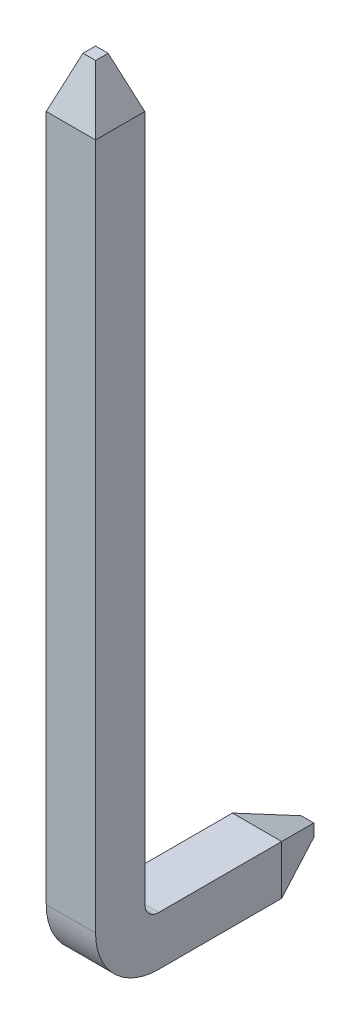
ISO-10303-21;
HEADER;
FILE_DESCRIPTION(('STEP AP214'),'2;1');
FILE_NAME('part.step','',(''),(''),'','','');
FILE_SCHEMA(('AUTOMOTIVE_DESIGN { 1 0 10303 214 1 1 1 1 }'));
ENDSEC;
DATA;
#1=APPLICATION_CONTEXT('core data for automotive mechanical design processes');
#2=APPLICATION_PROTOCOL_DEFINITION('international standard','automotive_design',2000,#1);
#3=PRODUCT_CONTEXT('',#1,'mechanical');
#4=PRODUCT('Part','Part','',(#3));
#5=PRODUCT_RELATED_PRODUCT_CATEGORY('part','',(#4));
#6=PRODUCT_DEFINITION_FORMATION('','',#4);
#7=PRODUCT_DEFINITION_CONTEXT('part definition',#1,'design');
#8=PRODUCT_DEFINITION('design','',#6,#7);
#9=PRODUCT_DEFINITION_SHAPE('','',#8);
#10=(LENGTH_UNIT() NAMED_UNIT(*) SI_UNIT(.MILLI.,.METRE.));
#11=(NAMED_UNIT(*) PLANE_ANGLE_UNIT() SI_UNIT($,.RADIAN.));
#12=(NAMED_UNIT(*) SI_UNIT($,.STERADIAN.) SOLID_ANGLE_UNIT());
#13=UNCERTAINTY_MEASURE_WITH_UNIT(LENGTH_MEASURE(1.E-05),#10,'distance_accuracy_value','');
#14=(GEOMETRIC_REPRESENTATION_CONTEXT(3) GLOBAL_UNCERTAINTY_ASSIGNED_CONTEXT((#13)) GLOBAL_UNIT_ASSIGNED_CONTEXT((#10,
#11,#12)) REPRESENTATION_CONTEXT('',''));
#15=CARTESIAN_POINT('',(0.,0.,0.));
#16=DIRECTION('',(0.,0.,1.));
#17=DIRECTION('',(1.,0.,0.));
#18=AXIS2_PLACEMENT_3D('',#15,#16,#17);
#19=CARTESIAN_POINT('',(0.,-9.5,-2.3987832623172));
#20=DIRECTION('',(0.939692620785909,0.,0.342020143325666));
#21=DIRECTION('',(0.342020143325666,0.,-0.939692620785909));
#22=AXIS2_PLACEMENT_3D('',#19,#20,#21);
#23=PLANE('',#22);
#24=DIRECTION('',(0.,1.,0.));
#25=VECTOR('',#24,1.);
#26=CARTESIAN_POINT('',(0.236580652273031,-10.3137832623172,-3.04878326231721));
#27=LINE('',#26,#25);
#28=CARTESIAN_POINT('',(0.236580652273031,-10.0772026100442,-3.04878326231721));
#29=VERTEX_POINT('',#28);
#30=CARTESIAN_POINT('',(0.236580652273031,-9.91536391459024,-3.04878326231721));
#31=VERTEX_POINT('',#30);
#32=EDGE_CURVE('E106',#29,#31,#27,.T.);
#33=ORIENTED_EDGE('',*,*,#32,.F.);
#34=DIRECTION('',(0.323615577118183,0.323615577118182,-0.88912649071599));
#35=VECTOR('',#34,1.);
#36=CARTESIAN_POINT('',(0.,-10.3137832623172,-2.3987832623172));
#37=LINE('',#36,#35);
#38=CARTESIAN_POINT('',(0.,-10.3137832623172,-2.3987832623172));
#39=VERTEX_POINT('',#38);
#40=EDGE_CURVE('E110',#39,#29,#37,.T.);
#41=ORIENTED_EDGE('',*,*,#40,.F.);
#42=DIRECTION('',(0.,1.,0.));
#43=VECTOR('',#42,1.);
#44=CARTESIAN_POINT('',(0.,-9.5,-2.3987832623172));
#45=LINE('',#44,#43);
#46=CARTESIAN_POINT('',(0.,-9.67878326231721,-2.3987832623172));
#47=VERTEX_POINT('',#46);
#48=EDGE_CURVE('E213',#47,#39,#45,.F.);
#49=ORIENTED_EDGE('',*,*,#48,.F.);
#50=DIRECTION('',(-0.323615577118183,0.323615577118182,0.88912649071599));
#51=VECTOR('',#50,1.);
#52=CARTESIAN_POINT('',(0.236580652273031,-9.91536391459024,-3.04878326231721));
#53=LINE('',#52,#51);
#54=EDGE_CURVE('E113',#31,#47,#53,.T.);
#55=ORIENTED_EDGE('',*,*,#54,.F.);
#56=EDGE_LOOP('',(#33,#41,#49,#55));
#57=FACE_BOUND('',#56,.T.);
#58=ADVANCED_FACE('F16',(#57),#23,.F.);
#59=CARTESIAN_POINT('',(0.236580652273031,0.,0.));
#60=DIRECTION('',(-0.939692620785909,0.342020143325666,0.));
#61=DIRECTION('',(-0.342020143325666,-0.939692620785909,0.));
#62=AXIS2_PLACEMENT_3D('',#59,#60,#61);
#63=PLANE('',#62);
#64=DIRECTION('',(0.323615577118183,0.88912649071599,0.323615577118183));
#65=VECTOR('',#64,1.);
#66=CARTESIAN_POINT('',(0.,-0.650000000000005,-0.635));
#67=LINE('',#66,#65);
#68=CARTESIAN_POINT('',(0.,-0.650000000000005,-0.635));
#69=VERTEX_POINT('',#68);
#70=CARTESIAN_POINT('',(0.236580652273031,0.,-0.398419347726969));
#71=VERTEX_POINT('',#70);
#72=EDGE_CURVE('E139',#69,#71,#67,.T.);
#73=ORIENTED_EDGE('',*,*,#72,.F.);
#74=DIRECTION('',(0.,0.,1.));
#75=VECTOR('',#74,1.);
#76=CARTESIAN_POINT('',(0.,-0.650000000000005,0.));
#77=LINE('',#76,#75);
#78=CARTESIAN_POINT('',(0.,-0.650000000000005,0.));
#79=VERTEX_POINT('',#78);
#80=EDGE_CURVE('E77',#79,#69,#77,.F.);
#81=ORIENTED_EDGE('',*,*,#80,.F.);
#82=DIRECTION('',(-0.323615577118183,-0.88912649071599,0.323615577118183));
#83=VECTOR('',#82,1.);
#84=CARTESIAN_POINT('',(0.236580652273031,0.,-0.236580652273031));
#85=LINE('',#84,#83);
#86=CARTESIAN_POINT('',(0.236580652273031,0.,-0.236580652273031));
#87=VERTEX_POINT('',#86);
#88=EDGE_CURVE('E197',#87,#79,#85,.T.);
#89=ORIENTED_EDGE('',*,*,#88,.F.);
#90=DIRECTION('',(0.,0.,-1.));
#91=VECTOR('',#90,1.);
#92=CARTESIAN_POINT('',(0.236580652273031,0.,0.));
#93=LINE('',#92,#91);
#94=EDGE_CURVE('E136',#87,#71,#93,.T.);
#95=ORIENTED_EDGE('',*,*,#94,.T.);
#96=EDGE_LOOP('',(#73,#81,#89,#95));
#97=FACE_BOUND('',#96,.T.);
#98=ADVANCED_FACE('F315',(#97),#63,.T.);
#99=CARTESIAN_POINT('',(0.,-10.3137832623172,-3.04878326231721));
#100=DIRECTION('',(0.,0.,-1.));
#101=DIRECTION('',(0.,1.,0.));
#102=AXIS2_PLACEMENT_3D('',#99,#100,#101);
#103=PLANE('',#102);
#104=ORIENTED_EDGE('',*,*,#32,.T.);
#105=DIRECTION('',(1.,0.,0.));
#106=VECTOR('',#105,1.);
#107=CARTESIAN_POINT('',(0.,-9.91536391459024,-3.04878326231721));
#108=LINE('',#107,#106);
#109=CARTESIAN_POINT('',(0.398419347726965,-9.91536391459024,-3.04878326231721));
#110=VERTEX_POINT('',#109);
#111=EDGE_CURVE('E124',#110,#31,#108,.F.);
#112=ORIENTED_EDGE('',*,*,#111,.F.);
#113=DIRECTION('',(0.,1.,0.));
#114=VECTOR('',#113,1.);
#115=CARTESIAN_POINT('',(0.398419347726966,-9.5,-3.04878326231721));
#116=LINE('',#115,#114);
#117=CARTESIAN_POINT('',(0.398419347726965,-10.0772026100442,-3.04878326231721));
#118=VERTEX_POINT('',#117);
#119=EDGE_CURVE('E120',#110,#118,#116,.F.);
#120=ORIENTED_EDGE('',*,*,#119,.T.);
#121=DIRECTION('',(1.,0.,0.));
#122=VECTOR('',#121,1.);
#123=CARTESIAN_POINT('',(0.,-10.0772026100442,-3.04878326231721));
#124=LINE('',#123,#122);
#125=EDGE_CURVE('E117',#29,#118,#124,.T.);
#126=ORIENTED_EDGE('',*,*,#125,.F.);
#127=EDGE_LOOP('',(#104,#112,#120,#126));
#128=FACE_BOUND('',#127,.T.);
#129=ADVANCED_FACE('F118',(#128),#103,.T.);
#130=CARTESIAN_POINT('',(0.,-10.3137832623172,-2.3987832623172));
#131=DIRECTION('',(0.,-0.93969262078591,-0.342020143325666));
#132=DIRECTION('',(0.,0.342020143325666,-0.93969262078591));
#133=AXIS2_PLACEMENT_3D('',#130,#131,#132);
#134=PLANE('',#133);
#135=DIRECTION('',(0.323615577118182,-0.323615577118184,0.889126490715989));
#136=VECTOR('',#135,1.);
#137=CARTESIAN_POINT('',(0.398419347726965,-10.0772026100442,-3.04878326231721));
#138=LINE('',#137,#136);
#139=CARTESIAN_POINT('',(0.634999999999997,-10.3137832623172,-2.3987832623172));
#140=VERTEX_POINT('',#139);
#141=EDGE_CURVE('E176',#118,#140,#138,.T.);
#142=ORIENTED_EDGE('',*,*,#141,.T.);
#143=DIRECTION('',(1.,0.,0.));
#144=VECTOR('',#143,1.);
#145=CARTESIAN_POINT('',(0.,-10.3137832623172,-2.3987832623172));
#146=LINE('',#145,#144);
#147=EDGE_CURVE('E128',#140,#39,#146,.F.);
#148=ORIENTED_EDGE('',*,*,#147,.T.);
#149=ORIENTED_EDGE('',*,*,#40,.T.);
#150=ORIENTED_EDGE('',*,*,#125,.T.);
#151=EDGE_LOOP('',(#142,#148,#149,#150));
#152=FACE_BOUND('',#151,.T.);
#153=ADVANCED_FACE('F126',(#152),#134,.T.);
#154=CARTESIAN_POINT('',(0.,-9.67878326231721,-2.3987832623172));
#155=DIRECTION('',(0.,0.93969262078591,-0.342020143325665));
#156=DIRECTION('',(0.,0.342020143325665,0.93969262078591));
#157=AXIS2_PLACEMENT_3D('',#154,#155,#156);
#158=PLANE('',#157);
#159=ORIENTED_EDGE('',*,*,#54,.T.);
#160=DIRECTION('',(1.,0.,0.));
#161=VECTOR('',#160,1.);
#162=CARTESIAN_POINT('',(0.,-9.67878326231721,-2.3987832623172));
#163=LINE('',#162,#161);
#164=CARTESIAN_POINT('',(0.634999999999997,-9.67878326231721,-2.3987832623172));
#165=VERTEX_POINT('',#164);
#166=EDGE_CURVE('E150',#47,#165,#163,.T.);
#167=ORIENTED_EDGE('',*,*,#166,.T.);
#168=DIRECTION('',(-0.323615577118183,-0.323615577118182,-0.88912649071599));
#169=VECTOR('',#168,1.);
#170=CARTESIAN_POINT('',(0.634999999999997,-9.67878326231721,-2.3987832623172));
#171=LINE('',#170,#169);
#172=EDGE_CURVE('E163',#165,#110,#171,.T.);
#173=ORIENTED_EDGE('',*,*,#172,.T.);
#174=ORIENTED_EDGE('',*,*,#111,.T.);
#175=EDGE_LOOP('',(#159,#167,#173,#174));
#176=FACE_BOUND('',#175,.T.);
#177=ADVANCED_FACE('F238',(#176),#158,.T.);
#178=CARTESIAN_POINT('',(0.,0.,-0.398419347726969));
#179=DIRECTION('',(0.,0.342020143325666,-0.939692620785909));
#180=DIRECTION('',(0.,0.939692620785909,0.342020143325666));
#181=AXIS2_PLACEMENT_3D('',#178,#179,#180);
#182=PLANE('',#181);
#183=ORIENTED_EDGE('',*,*,#72,.T.);
#184=DIRECTION('',(1.,0.,0.));
#185=VECTOR('',#184,1.);
#186=CARTESIAN_POINT('',(0.,0.,-0.398419347726969));
#187=LINE('',#186,#185);
#188=CARTESIAN_POINT('',(0.398419347726965,0.,-0.398419347726969));
#189=VERTEX_POINT('',#188);
#190=EDGE_CURVE('E138',#71,#189,#187,.T.);
#191=ORIENTED_EDGE('',*,*,#190,.T.);
#192=DIRECTION('',(-0.323615577118183,0.88912649071599,0.323615577118183));
#193=VECTOR('',#192,1.);
#194=CARTESIAN_POINT('',(0.634999999999997,-0.650000000000005,-0.635));
#195=LINE('',#194,#193);
#196=CARTESIAN_POINT('',(0.634999999999997,-0.650000000000005,-0.635000000000001));
#197=VERTEX_POINT('',#196);
#198=EDGE_CURVE('E205',#197,#189,#195,.T.);
#199=ORIENTED_EDGE('',*,*,#198,.F.);
#200=DIRECTION('',(1.,0.,0.));
#201=VECTOR('',#200,1.);
#202=CARTESIAN_POINT('',(0.,-0.650000000000005,-0.635));
#203=LINE('',#202,#201);
#204=EDGE_CURVE('E218',#69,#197,#203,.T.);
#205=ORIENTED_EDGE('',*,*,#204,.F.);
#206=EDGE_LOOP('',(#183,#191,#199,#205));
#207=FACE_BOUND('',#206,.T.);
#208=ADVANCED_FACE('F320',(#207),#182,.T.);
#209=CARTESIAN_POINT('',(0.,0.,0.));
#210=DIRECTION('',(0.,-1.,0.));
#211=DIRECTION('',(0.,0.,-1.));
#212=AXIS2_PLACEMENT_3D('',#209,#210,#211);
#213=PLANE('',#212);
#214=ORIENTED_EDGE('',*,*,#190,.F.);
#215=ORIENTED_EDGE('',*,*,#94,.F.);
#216=DIRECTION('',(1.,0.,0.));
#217=VECTOR('',#216,1.);
#218=CARTESIAN_POINT('',(0.,0.,-0.236580652273031));
#219=LINE('',#218,#217);
#220=CARTESIAN_POINT('',(0.398419347726965,0.,-0.236580652273031));
#221=VERTEX_POINT('',#220);
#222=EDGE_CURVE('E199',#221,#87,#219,.F.);
#223=ORIENTED_EDGE('',*,*,#222,.F.);
#224=DIRECTION('',(0.,0.,1.));
#225=VECTOR('',#224,1.);
#226=CARTESIAN_POINT('',(0.398419347726965,0.,0.));
#227=LINE('',#226,#225);
#228=EDGE_CURVE('E202',#189,#221,#227,.T.);
#229=ORIENTED_EDGE('',*,*,#228,.F.);
#230=EDGE_LOOP('',(#214,#215,#223,#229));
#231=FACE_BOUND('',#230,.T.);
#232=ADVANCED_FACE('F318',(#231),#213,.F.);
#233=CARTESIAN_POINT('',(0.,0.,-0.236580652273031));
#234=DIRECTION('',(0.,0.342020143325666,0.939692620785909));
#235=DIRECTION('',(0.,-0.939692620785909,0.342020143325666));
#236=AXIS2_PLACEMENT_3D('',#233,#234,#235);
#237=PLANE('',#236);
#238=DIRECTION('',(0.323615577118183,-0.88912649071599,0.323615577118183));
#239=VECTOR('',#238,1.);
#240=CARTESIAN_POINT('',(0.398419347726965,0.,-0.236580652273031));
#241=LINE('',#240,#239);
#242=CARTESIAN_POINT('',(0.634999999999997,-0.650000000000005,0.));
#243=VERTEX_POINT('',#242);
#244=EDGE_CURVE('E285',#221,#243,#241,.T.);
#245=ORIENTED_EDGE('',*,*,#244,.F.);
#246=ORIENTED_EDGE('',*,*,#222,.T.);
#247=ORIENTED_EDGE('',*,*,#88,.T.);
#248=DIRECTION('',(1.,0.,0.));
#249=VECTOR('',#248,1.);
#250=CARTESIAN_POINT('',(0.,-0.650000000000005,0.));
#251=LINE('',#250,#249);
#252=EDGE_CURVE('E191',#243,#79,#251,.F.);
#253=ORIENTED_EDGE('',*,*,#252,.F.);
#254=EDGE_LOOP('',(#245,#246,#247,#253));
#255=FACE_BOUND('',#254,.T.);
#256=ADVANCED_FACE('F312',(#255),#237,.T.);
#257=CARTESIAN_POINT('',(0.,-9.5,0.));
#258=DIRECTION('',(-1.,0.,0.));
#259=DIRECTION('',(0.,0.,1.));
#260=AXIS2_PLACEMENT_3D('',#257,#258,#259);
#261=PLANE('',#260);
#262=DIRECTION('',(0.,1.,0.));
#263=VECTOR('',#262,1.);
#264=CARTESIAN_POINT('',(0.,-9.5,-0.635000000000001));
#265=LINE('',#264,#263);
#266=CARTESIAN_POINT('',(0.,-9.5,-0.635000000000001));
#267=VERTEX_POINT('',#266);
#268=EDGE_CURVE('E154',#267,#69,#265,.T.);
#269=ORIENTED_EDGE('',*,*,#268,.F.);
#270=CARTESIAN_POINT('',(0.,-9.5,-0.813783262317208));
#271=DIRECTION('',(1.,0.,0.));
#272=DIRECTION('',(0.,0.,-1.));
#273=AXIS2_PLACEMENT_3D('',#270,#271,#272);
#274=CIRCLE('',#273,0.178783262317206);
#275=CARTESIAN_POINT('',(0.,-9.67878326231721,-0.813783262317208));
#276=VERTEX_POINT('',#275);
#277=EDGE_CURVE('E148',#267,#276,#274,.T.);
#278=ORIENTED_EDGE('',*,*,#277,.T.);
#279=DIRECTION('',(0.,0.,-1.));
#280=VECTOR('',#279,1.);
#281=CARTESIAN_POINT('',(0.,-9.67878326231721,-0.813783262317208));
#282=LINE('',#281,#280);
#283=EDGE_CURVE('E157',#276,#47,#282,.T.);
#284=ORIENTED_EDGE('',*,*,#283,.T.);
#285=ORIENTED_EDGE('',*,*,#48,.T.);
#286=DIRECTION('',(0.,0.,1.));
#287=VECTOR('',#286,1.);
#288=CARTESIAN_POINT('',(0.,-10.3137832623172,-0.813783262317208));
#289=LINE('',#288,#287);
#290=CARTESIAN_POINT('',(0.,-10.3137832623172,-0.813783262317208));
#291=VERTEX_POINT('',#290);
#292=EDGE_CURVE('E183',#39,#291,#289,.T.);
#293=ORIENTED_EDGE('',*,*,#292,.T.);
#294=CARTESIAN_POINT('',(0.,-9.5,-0.813783262317208));
#295=DIRECTION('',(1.,0.,0.));
#296=DIRECTION('',(0.,0.,-1.));
#297=AXIS2_PLACEMENT_3D('',#294,#295,#296);
#298=CIRCLE('',#297,0.813783262317207);
#299=CARTESIAN_POINT('',(0.,-9.5,0.));
#300=VERTEX_POINT('',#299);
#301=EDGE_CURVE('E19',#291,#300,#298,.F.);
#302=ORIENTED_EDGE('',*,*,#301,.T.);
#303=DIRECTION('',(0.,-1.,0.));
#304=VECTOR('',#303,1.);
#305=CARTESIAN_POINT('',(0.,-9.5,0.));
#306=LINE('',#305,#304);
#307=EDGE_CURVE('E189',#79,#300,#306,.T.);
#308=ORIENTED_EDGE('',*,*,#307,.F.);
#309=ORIENTED_EDGE('',*,*,#80,.T.);
#310=EDGE_LOOP('',(#269,#278,#284,#285,#293,#302,#308,#309));
#311=FACE_BOUND('',#310,.T.);
#312=ADVANCED_FACE('F249',(#311),#261,.T.);
#313=CARTESIAN_POINT('',(0.,-10.3137832623172,-0.813783262317208));
#314=DIRECTION('',(0.,1.,0.));
#315=DIRECTION('',(0.,0.,1.));
#316=AXIS2_PLACEMENT_3D('',#313,#314,#315);
#317=PLANE('',#316);
#318=ORIENTED_EDGE('',*,*,#147,.F.);
#319=DIRECTION('',(0.,0.,-1.));
#320=VECTOR('',#319,1.);
#321=CARTESIAN_POINT('',(0.634999999999997,-10.3137832623172,0.));
#322=LINE('',#321,#320);
#323=CARTESIAN_POINT('',(0.634999999999997,-10.3137832623172,-0.813783262317208));
#324=VERTEX_POINT('',#323);
#325=EDGE_CURVE('E172',#324,#140,#322,.T.);
#326=ORIENTED_EDGE('',*,*,#325,.F.);
#327=DIRECTION('',(1.,0.,0.));
#328=VECTOR('',#327,1.);
#329=CARTESIAN_POINT('',(0.,-10.3137832623172,-0.813783262317208));
#330=LINE('',#329,#328);
#331=EDGE_CURVE('E248',#291,#324,#330,.T.);
#332=ORIENTED_EDGE('',*,*,#331,.F.);
#333=ORIENTED_EDGE('',*,*,#292,.F.);
#334=EDGE_LOOP('',(#318,#326,#332,#333));
#335=FACE_BOUND('',#334,.T.);
#336=ADVANCED_FACE('F246',(#335),#317,.F.);
#337=CARTESIAN_POINT('',(0.634999999999997,-9.5,-2.3987832623172));
#338=DIRECTION('',(-0.939692620785909,0.,0.342020143325666));
#339=DIRECTION('',(0.342020143325666,0.,0.939692620785909));
#340=AXIS2_PLACEMENT_3D('',#337,#338,#339);
#341=PLANE('',#340);
#342=DIRECTION('',(0.,1.,0.));
#343=VECTOR('',#342,1.);
#344=CARTESIAN_POINT('',(0.634999999999997,-9.5,-2.3987832623172));
#345=LINE('',#344,#343);
#346=EDGE_CURVE('E169',#140,#165,#345,.T.);
#347=ORIENTED_EDGE('',*,*,#346,.F.);
#348=ORIENTED_EDGE('',*,*,#141,.F.);
#349=ORIENTED_EDGE('',*,*,#119,.F.);
#350=ORIENTED_EDGE('',*,*,#172,.F.);
#351=EDGE_LOOP('',(#347,#348,#349,#350));
#352=FACE_BOUND('',#351,.T.);
#353=ADVANCED_FACE('F242',(#352),#341,.F.);
#354=CARTESIAN_POINT('',(0.,-9.67878326231721,-0.813783262317208));
#355=DIRECTION('',(0.,-1.,0.));
#356=DIRECTION('',(0.,0.,-1.));
#357=AXIS2_PLACEMENT_3D('',#354,#355,#356);
#358=PLANE('',#357);
#359=ORIENTED_EDGE('',*,*,#166,.F.);
#360=ORIENTED_EDGE('',*,*,#283,.F.);
#361=DIRECTION('',(1.,0.,0.));
#362=VECTOR('',#361,1.);
#363=CARTESIAN_POINT('',(0.,-9.67878326231721,-0.813783262317208));
#364=LINE('',#363,#362);
#365=CARTESIAN_POINT('',(0.634999999999997,-9.67878326231721,-0.813783262317208));
#366=VERTEX_POINT('',#365);
#367=EDGE_CURVE('E149',#276,#366,#364,.T.);
#368=ORIENTED_EDGE('',*,*,#367,.T.);
#369=DIRECTION('',(0.,0.,-1.));
#370=VECTOR('',#369,1.);
#371=CARTESIAN_POINT('',(0.634999999999997,-9.67878326231721,0.));
#372=LINE('',#371,#370);
#373=EDGE_CURVE('E147',#165,#366,#372,.F.);
#374=ORIENTED_EDGE('',*,*,#373,.F.);
#375=EDGE_LOOP('',(#359,#360,#368,#374));
#376=FACE_BOUND('',#375,.T.);
#377=ADVANCED_FACE('F252',(#376),#358,.F.);
#378=CARTESIAN_POINT('',(0.,-9.5,-0.813783262317208));
#379=DIRECTION('',(1.,0.,0.));
#380=DIRECTION('',(0.,0.,-1.));
#381=AXIS2_PLACEMENT_3D('',#378,#379,#380);
#382=CYLINDRICAL_SURFACE('',#381,0.178783262317206);
#383=CARTESIAN_POINT('',(0.634999999999997,-9.5,-0.813783262317208));
#384=DIRECTION('',(1.,0.,0.));
#385=DIRECTION('',(0.,0.,-1.));
#386=AXIS2_PLACEMENT_3D('',#383,#384,#385);
#387=CIRCLE('',#386,0.178783262317206);
#388=CARTESIAN_POINT('',(0.634999999999997,-9.5,-0.635000000000001));
#389=VERTEX_POINT('',#388);
#390=EDGE_CURVE('E144',#366,#389,#387,.F.);
#391=ORIENTED_EDGE('',*,*,#390,.F.);
#392=ORIENTED_EDGE('',*,*,#367,.F.);
#393=ORIENTED_EDGE('',*,*,#277,.F.);
#394=DIRECTION('',(1.,0.,0.));
#395=VECTOR('',#394,1.);
#396=CARTESIAN_POINT('',(0.,-9.5,-0.635000000000001));
#397=LINE('',#396,#395);
#398=EDGE_CURVE('E258',#389,#267,#397,.F.);
#399=ORIENTED_EDGE('',*,*,#398,.F.);
#400=EDGE_LOOP('',(#391,#392,#393,#399));
#401=FACE_BOUND('',#400,.T.);
#402=ADVANCED_FACE('F255',(#401),#382,.F.);
#403=CARTESIAN_POINT('',(0.,-9.5,-0.635000000000001));
#404=DIRECTION('',(0.,0.,-1.));
#405=DIRECTION('',(0.,1.,0.));
#406=AXIS2_PLACEMENT_3D('',#403,#404,#405);
#407=PLANE('',#406);
#408=DIRECTION('',(0.,1.,0.));
#409=VECTOR('',#408,1.);
#410=CARTESIAN_POINT('',(0.634999999999997,-9.5,-0.635000000000001));
#411=LINE('',#410,#409);
#412=EDGE_CURVE('E146',#389,#197,#411,.T.);
#413=ORIENTED_EDGE('',*,*,#412,.F.);
#414=ORIENTED_EDGE('',*,*,#398,.T.);
#415=ORIENTED_EDGE('',*,*,#268,.T.);
#416=ORIENTED_EDGE('',*,*,#204,.T.);
#417=EDGE_LOOP('',(#413,#414,#415,#416));
#418=FACE_BOUND('',#417,.T.);
#419=ADVANCED_FACE('F300',(#418),#407,.T.);
#420=CARTESIAN_POINT('',(0.398419347726965,0.,0.));
#421=DIRECTION('',(0.939692620785909,0.342020143325666,0.));
#422=DIRECTION('',(-0.342020143325666,0.939692620785909,0.));
#423=AXIS2_PLACEMENT_3D('',#420,#421,#422);
#424=PLANE('',#423);
#425=ORIENTED_EDGE('',*,*,#198,.T.);
#426=ORIENTED_EDGE('',*,*,#228,.T.);
#427=ORIENTED_EDGE('',*,*,#244,.T.);
#428=DIRECTION('',(0.,0.,-1.));
#429=VECTOR('',#428,1.);
#430=CARTESIAN_POINT('',(0.634999999999997,-0.650000000000005,0.));
#431=LINE('',#430,#429);
#432=EDGE_CURVE('E280',#197,#243,#431,.F.);
#433=ORIENTED_EDGE('',*,*,#432,.F.);
#434=EDGE_LOOP('',(#425,#426,#427,#433));
#435=FACE_BOUND('',#434,.T.);
#436=ADVANCED_FACE('F305',(#435),#424,.T.);
#437=CARTESIAN_POINT('',(0.,-9.5,0.));
#438=DIRECTION('',(0.,0.,1.));
#439=DIRECTION('',(0.,-1.,0.));
#440=AXIS2_PLACEMENT_3D('',#437,#438,#439);
#441=PLANE('',#440);
#442=ORIENTED_EDGE('',*,*,#307,.T.);
#443=DIRECTION('',(1.,0.,0.));
#444=VECTOR('',#443,1.);
#445=CARTESIAN_POINT('',(0.,-9.5,0.));
#446=LINE('',#445,#444);
#447=CARTESIAN_POINT('',(0.634999999999997,-9.5,0.));
#448=VERTEX_POINT('',#447);
#449=EDGE_CURVE('E34',#448,#300,#446,.F.);
#450=ORIENTED_EDGE('',*,*,#449,.F.);
#451=DIRECTION('',(0.,1.,0.));
#452=VECTOR('',#451,1.);
#453=CARTESIAN_POINT('',(0.634999999999997,-9.5,0.));
#454=LINE('',#453,#452);
#455=EDGE_CURVE('E25',#243,#448,#454,.F.);
#456=ORIENTED_EDGE('',*,*,#455,.F.);
#457=ORIENTED_EDGE('',*,*,#252,.T.);
#458=EDGE_LOOP('',(#442,#450,#456,#457));
#459=FACE_BOUND('',#458,.T.);
#460=ADVANCED_FACE('F310',(#459),#441,.T.);
#461=CARTESIAN_POINT('',(0.,-9.5,-0.813783262317208));
#462=DIRECTION('',(1.,0.,0.));
#463=DIRECTION('',(0.,0.,-1.));
#464=AXIS2_PLACEMENT_3D('',#461,#462,#463);
#465=CYLINDRICAL_SURFACE('',#464,0.813783262317207);
#466=ORIENTED_EDGE('',*,*,#331,.T.);
#467=CARTESIAN_POINT('',(0.634999999999997,-9.5,-0.813783262317208));
#468=DIRECTION('',(1.,0.,0.));
#469=DIRECTION('',(0.,0.,-1.));
#470=AXIS2_PLACEMENT_3D('',#467,#468,#469);
#471=CIRCLE('',#470,0.813783262317207);
#472=EDGE_CURVE('E11',#448,#324,#471,.T.);
#473=ORIENTED_EDGE('',*,*,#472,.F.);
#474=ORIENTED_EDGE('',*,*,#449,.T.);
#475=ORIENTED_EDGE('',*,*,#301,.F.);
#476=EDGE_LOOP('',(#466,#473,#474,#475));
#477=FACE_BOUND('',#476,.T.);
#478=ADVANCED_FACE('F331',(#477),#465,.T.);
#479=CARTESIAN_POINT('',(0.634999999999997,-9.5,0.));
#480=DIRECTION('',(1.,0.,0.));
#481=DIRECTION('',(0.,0.,-1.));
#482=AXIS2_PLACEMENT_3D('',#479,#480,#481);
#483=PLANE('',#482);
#484=ORIENTED_EDGE('',*,*,#455,.T.);
#485=ORIENTED_EDGE('',*,*,#472,.T.);
#486=ORIENTED_EDGE('',*,*,#325,.T.);
#487=ORIENTED_EDGE('',*,*,#346,.T.);
#488=ORIENTED_EDGE('',*,*,#373,.T.);
#489=ORIENTED_EDGE('',*,*,#390,.T.);
#490=ORIENTED_EDGE('',*,*,#412,.T.);
#491=ORIENTED_EDGE('',*,*,#432,.T.);
#492=EDGE_LOOP('',(#484,#485,#486,#487,#488,#489,#490,#491));
#493=FACE_BOUND('',#492,.T.);
#494=ADVANCED_FACE('F263',(#493),#483,.T.);
#495=CLOSED_SHELL('',(#58,#98,#129,#153,#177,#208,#232,#256,#312,#336,#353,#377,#402,#419,#436,
#460,#478,#494));
#496=MANIFOLD_SOLID_BREP('B1',#495);
#497=ADVANCED_BREP_SHAPE_REPRESENTATION('',(#18,#496),#14);
#498=SHAPE_DEFINITION_REPRESENTATION(#9,#497);
ENDSEC;
END-ISO-10303-21;
